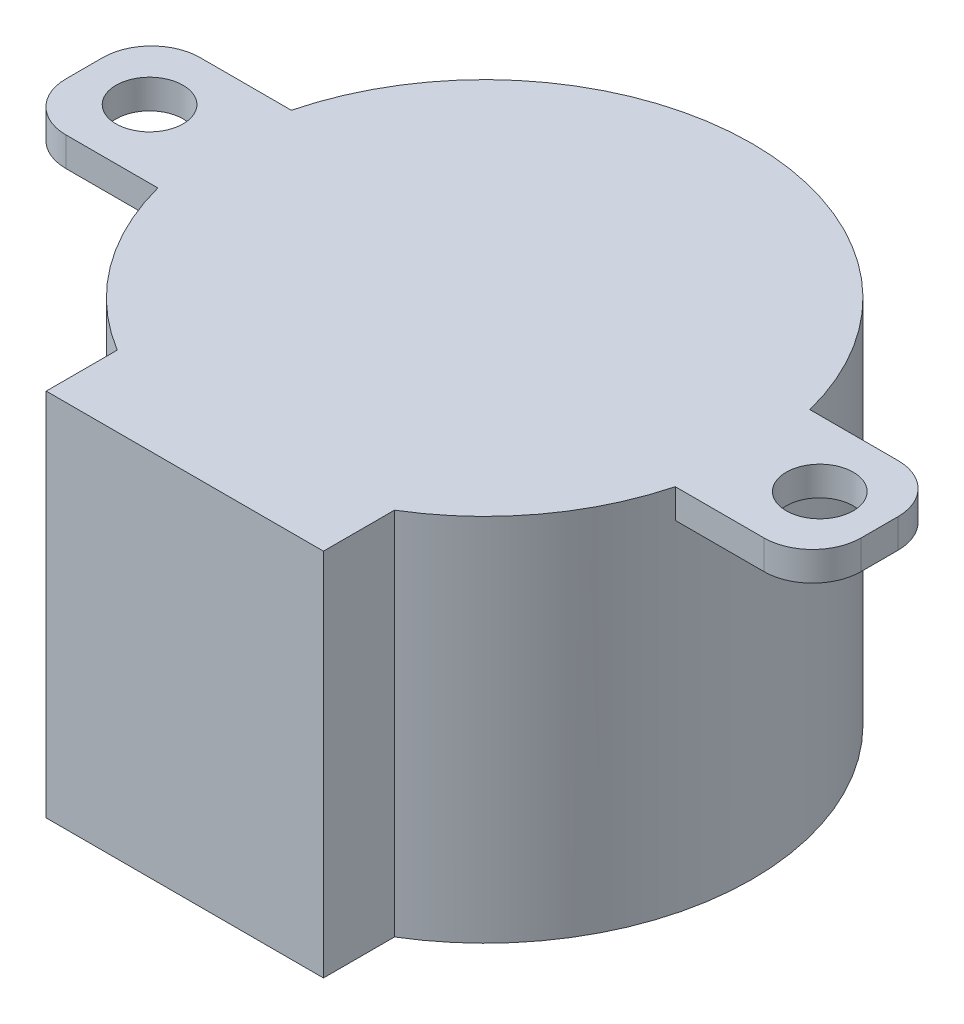
ISO-10303-21;
HEADER;
FILE_DESCRIPTION(('STEP AP214'),'2;1');
FILE_NAME('part.step','',(''),(''),'','','');
FILE_SCHEMA(('AUTOMOTIVE_DESIGN { 1 0 10303 214 1 1 1 1 }'));
ENDSEC;
DATA;
#1=APPLICATION_CONTEXT('core data for automotive mechanical design processes');
#2=APPLICATION_PROTOCOL_DEFINITION('international standard','automotive_design',2000,#1);
#3=PRODUCT_CONTEXT('',#1,'mechanical');
#4=PRODUCT('Part','Part','',(#3));
#5=PRODUCT_RELATED_PRODUCT_CATEGORY('part','',(#4));
#6=PRODUCT_DEFINITION_FORMATION('','',#4);
#7=PRODUCT_DEFINITION_CONTEXT('part definition',#1,'design');
#8=PRODUCT_DEFINITION('design','',#6,#7);
#9=PRODUCT_DEFINITION_SHAPE('','',#8);
#10=(LENGTH_UNIT() NAMED_UNIT(*) SI_UNIT(.MILLI.,.METRE.));
#11=(NAMED_UNIT(*) PLANE_ANGLE_UNIT() SI_UNIT($,.RADIAN.));
#12=(NAMED_UNIT(*) SI_UNIT($,.STERADIAN.) SOLID_ANGLE_UNIT());
#13=UNCERTAINTY_MEASURE_WITH_UNIT(LENGTH_MEASURE(1.E-05),#10,'distance_accuracy_value','');
#14=(GEOMETRIC_REPRESENTATION_CONTEXT(3) GLOBAL_UNCERTAINTY_ASSIGNED_CONTEXT((#13)) GLOBAL_UNIT_ASSIGNED_CONTEXT((#10,
#11,#12)) REPRESENTATION_CONTEXT('',''));
#15=CARTESIAN_POINT('',(0.,0.,0.));
#16=DIRECTION('',(0.,0.,1.));
#17=DIRECTION('',(1.,0.,0.));
#18=AXIS2_PLACEMENT_3D('',#15,#16,#17);
#19=CARTESIAN_POINT('',(0.,19.304,0.));
#20=DIRECTION('',(0.,1.,0.));
#21=DIRECTION('',(0.,0.,1.));
#22=AXIS2_PLACEMENT_3D('',#19,#20,#21);
#23=PLANE('',#22);
#24=CARTESIAN_POINT('',(17.499965,19.304,0.));
#25=DIRECTION('',(0.,1.,0.));
#26=DIRECTION('',(0.,0.,1.));
#27=AXIS2_PLACEMENT_3D('',#24,#25,#26);
#28=CIRCLE('',#27,1.75);
#29=CARTESIAN_POINT('',(17.499965,19.304,1.75));
#30=VERTEX_POINT('',#29);
#31=EDGE_CURVE('E160',#30,#30,#28,.T.);
#32=ORIENTED_EDGE('',*,*,#31,.F.);
#33=EDGE_LOOP('',(#32));
#34=FACE_BOUND('',#33,.T.);
#35=DIRECTION('',(0.,0.,-1.));
#36=VECTOR('',#35,1.);
#37=CARTESIAN_POINT('',(7.239,19.304,11.9481286819317));
#38=LINE('',#37,#36);
#39=CARTESIAN_POINT('',(7.239,19.304,15.658308150025));
#40=VERTEX_POINT('',#39);
#41=CARTESIAN_POINT('',(7.239,19.304,11.9481286819317));
#42=VERTEX_POINT('',#41);
#43=EDGE_CURVE('E167',#40,#42,#38,.T.);
#44=ORIENTED_EDGE('',*,*,#43,.T.);
#45=CARTESIAN_POINT('',(0.,19.304,0.));
#46=DIRECTION('',(0.,1.,0.));
#47=DIRECTION('',(0.,0.,1.));
#48=AXIS2_PLACEMENT_3D('',#45,#46,#47);
#49=CIRCLE('',#48,13.97);
#50=CARTESIAN_POINT('',(13.5098395253238,19.304,3.556));
#51=VERTEX_POINT('',#50);
#52=EDGE_CURVE('E91',#42,#51,#49,.T.);
#53=ORIENTED_EDGE('',*,*,#52,.T.);
#54=DIRECTION('',(1.,0.,0.));
#55=VECTOR('',#54,1.);
#56=CARTESIAN_POINT('',(13.5098395253238,19.304,3.556));
#57=LINE('',#56,#55);
#58=CARTESIAN_POINT('',(18.1390059016236,19.304,3.556));
#59=VERTEX_POINT('',#58);
#60=EDGE_CURVE('E284',#51,#59,#57,.T.);
#61=ORIENTED_EDGE('',*,*,#60,.T.);
#62=CARTESIAN_POINT('',(18.1390059016236,19.304,1.016));
#63=DIRECTION('',(0.,1.,0.));
#64=DIRECTION('',(0.,0.,1.));
#65=AXIS2_PLACEMENT_3D('',#62,#63,#64);
#66=CIRCLE('',#65,2.54);
#67=CARTESIAN_POINT('',(20.6790059016236,19.304,1.01599999999998));
#68=VERTEX_POINT('',#67);
#69=EDGE_CURVE('E287',#59,#68,#66,.T.);
#70=ORIENTED_EDGE('',*,*,#69,.T.);
#71=DIRECTION('',(0.,0.,-1.));
#72=VECTOR('',#71,1.);
#73=CARTESIAN_POINT('',(20.6790059016236,19.304,-0.903999999999982));
#74=LINE('',#73,#72);
#75=CARTESIAN_POINT('',(20.6790059016236,19.304,-0.903999999999982));
#76=VERTEX_POINT('',#75);
#77=EDGE_CURVE('E290',#68,#76,#74,.T.);
#78=ORIENTED_EDGE('',*,*,#77,.T.);
#79=CARTESIAN_POINT('',(18.1390059016236,19.304,-0.904));
#80=DIRECTION('',(0.,1.,0.));
#81=DIRECTION('',(0.,0.,-1.));
#82=AXIS2_PLACEMENT_3D('',#79,#80,#81);
#83=CIRCLE('',#82,2.54);
#84=CARTESIAN_POINT('',(18.1390059016236,19.304,-3.444));
#85=VERTEX_POINT('',#84);
#86=EDGE_CURVE('E293',#76,#85,#83,.T.);
#87=ORIENTED_EDGE('',*,*,#86,.T.);
#88=DIRECTION('',(-1.,0.,0.));
#89=VECTOR('',#88,1.);
#90=CARTESIAN_POINT('',(13.5388243211883,19.304,-3.444));
#91=LINE('',#90,#89);
#92=CARTESIAN_POINT('',(13.5388243211883,19.304,-3.444));
#93=VERTEX_POINT('',#92);
#94=EDGE_CURVE('E296',#85,#93,#91,.T.);
#95=ORIENTED_EDGE('',*,*,#94,.T.);
#96=CARTESIAN_POINT('',(0.,19.304,0.));
#97=DIRECTION('',(0.,1.,0.));
#98=DIRECTION('',(0.,0.,1.));
#99=AXIS2_PLACEMENT_3D('',#96,#97,#98);
#100=CIRCLE('',#99,13.97);
#101=CARTESIAN_POINT('',(-13.5388243211883,19.304,-3.444));
#102=VERTEX_POINT('',#101);
#103=EDGE_CURVE('E299',#93,#102,#100,.T.);
#104=ORIENTED_EDGE('',*,*,#103,.T.);
#105=DIRECTION('',(-1.,0.,0.));
#106=VECTOR('',#105,1.);
#107=CARTESIAN_POINT('',(-18.3054451484847,19.304,-3.444));
#108=LINE('',#107,#106);
#109=CARTESIAN_POINT('',(-18.3054451484847,19.304,-3.444));
#110=VERTEX_POINT('',#109);
#111=EDGE_CURVE('E302',#102,#110,#108,.T.);
#112=ORIENTED_EDGE('',*,*,#111,.T.);
#113=CARTESIAN_POINT('',(-18.3054451484847,19.304,-0.904));
#114=DIRECTION('',(0.,1.,0.));
#115=DIRECTION('',(0.,0.,1.));
#116=AXIS2_PLACEMENT_3D('',#113,#114,#115);
#117=CIRCLE('',#116,2.54);
#118=CARTESIAN_POINT('',(-20.8454451484847,19.304,-0.903999999999982));
#119=VERTEX_POINT('',#118);
#120=EDGE_CURVE('E305',#110,#119,#117,.T.);
#121=ORIENTED_EDGE('',*,*,#120,.T.);
#122=DIRECTION('',(0.,0.,1.));
#123=VECTOR('',#122,1.);
#124=CARTESIAN_POINT('',(-20.8454451484847,19.304,-0.903999999999982));
#125=LINE('',#124,#123);
#126=CARTESIAN_POINT('',(-20.8454451484847,19.304,1.01599999999998));
#127=VERTEX_POINT('',#126);
#128=EDGE_CURVE('E308',#119,#127,#125,.T.);
#129=ORIENTED_EDGE('',*,*,#128,.T.);
#130=CARTESIAN_POINT('',(-18.3054451484847,19.304,1.016));
#131=DIRECTION('',(0.,1.,0.));
#132=DIRECTION('',(0.,0.,1.));
#133=AXIS2_PLACEMENT_3D('',#130,#131,#132);
#134=CIRCLE('',#133,2.54);
#135=CARTESIAN_POINT('',(-18.3054451484847,19.304,3.556));
#136=VERTEX_POINT('',#135);
#137=EDGE_CURVE('E311',#127,#136,#134,.T.);
#138=ORIENTED_EDGE('',*,*,#137,.T.);
#139=DIRECTION('',(1.,0.,0.));
#140=VECTOR('',#139,1.);
#141=CARTESIAN_POINT('',(-18.3054451484847,19.304,3.556));
#142=LINE('',#141,#140);
#143=CARTESIAN_POINT('',(-13.5098395253238,19.304,3.55599999999999));
#144=VERTEX_POINT('',#143);
#145=EDGE_CURVE('E136',#136,#144,#142,.T.);
#146=ORIENTED_EDGE('',*,*,#145,.T.);
#147=CARTESIAN_POINT('',(0.,19.304,0.));
#148=DIRECTION('',(0.,1.,0.));
#149=DIRECTION('',(0.,0.,1.));
#150=AXIS2_PLACEMENT_3D('',#147,#148,#149);
#151=CIRCLE('',#150,13.97);
#152=CARTESIAN_POINT('',(-7.239,19.304,11.9481286819317));
#153=VERTEX_POINT('',#152);
#154=EDGE_CURVE('E130',#144,#153,#151,.T.);
#155=ORIENTED_EDGE('',*,*,#154,.T.);
#156=DIRECTION('',(0.,0.,1.));
#157=VECTOR('',#156,1.);
#158=CARTESIAN_POINT('',(-7.239,19.304,11.9481286819317));
#159=LINE('',#158,#157);
#160=CARTESIAN_POINT('',(-7.239,19.304,15.658308150025));
#161=VERTEX_POINT('',#160);
#162=EDGE_CURVE('E134',#153,#161,#159,.T.);
#163=ORIENTED_EDGE('',*,*,#162,.T.);
#164=DIRECTION('',(1.,0.,0.));
#165=VECTOR('',#164,1.);
#166=CARTESIAN_POINT('',(-7.239,19.304,15.658308150025));
#167=LINE('',#166,#165);
#168=EDGE_CURVE('E59',#161,#40,#167,.T.);
#169=ORIENTED_EDGE('',*,*,#168,.T.);
#170=EDGE_LOOP('',(#44,#53,#61,#70,#78,#87,#95,#104,#112,#121,#129,#138,#146,#155,#163,#169));
#171=FACE_BOUND('',#170,.T.);
#172=CARTESIAN_POINT('',(-17.499965,19.304,0.));
#173=DIRECTION('',(0.,1.,0.));
#174=DIRECTION('',(0.,0.,-1.));
#175=AXIS2_PLACEMENT_3D('',#172,#173,#174);
#176=CIRCLE('',#175,1.75);
#177=CARTESIAN_POINT('',(-17.499965,19.304,-1.75));
#178=VERTEX_POINT('',#177);
#179=EDGE_CURVE('E273',#178,#178,#176,.T.);
#180=ORIENTED_EDGE('',*,*,#179,.F.);
#181=EDGE_LOOP('',(#180));
#182=FACE_BOUND('',#181,.T.);
#183=ADVANCED_FACE('F39',(#34,#171,#182),#23,.T.);
#184=CARTESIAN_POINT('',(0.,0.,0.));
#185=DIRECTION('',(0.,1.,0.));
#186=DIRECTION('',(0.,0.,1.));
#187=AXIS2_PLACEMENT_3D('',#184,#185,#186);
#188=PLANE('',#187);
#189=CARTESIAN_POINT('',(0.,0.,0.));
#190=DIRECTION('',(0.,1.,0.));
#191=DIRECTION('',(0.,0.,1.));
#192=AXIS2_PLACEMENT_3D('',#189,#190,#191);
#193=CIRCLE('',#192,13.97);
#194=CARTESIAN_POINT('',(7.239,0.,11.9481286819317));
#195=VERTEX_POINT('',#194);
#196=CARTESIAN_POINT('',(-7.239,0.,11.9481286819317));
#197=VERTEX_POINT('',#196);
#198=EDGE_CURVE('E143',#195,#197,#193,.T.);
#199=ORIENTED_EDGE('',*,*,#198,.F.);
#200=DIRECTION('',(0.,0.,-1.));
#201=VECTOR('',#200,1.);
#202=CARTESIAN_POINT('',(7.239,0.,11.9481286819317));
#203=LINE('',#202,#201);
#204=CARTESIAN_POINT('',(7.239,0.,15.658308150025));
#205=VERTEX_POINT('',#204);
#206=EDGE_CURVE('E156',#205,#195,#203,.T.);
#207=ORIENTED_EDGE('',*,*,#206,.F.);
#208=DIRECTION('',(1.,0.,0.));
#209=VECTOR('',#208,1.);
#210=CARTESIAN_POINT('',(-7.239,0.,15.658308150025));
#211=LINE('',#210,#209);
#212=CARTESIAN_POINT('',(-7.239,0.,15.658308150025));
#213=VERTEX_POINT('',#212);
#214=EDGE_CURVE('E83',#213,#205,#211,.T.);
#215=ORIENTED_EDGE('',*,*,#214,.F.);
#216=DIRECTION('',(0.,0.,1.));
#217=VECTOR('',#216,1.);
#218=CARTESIAN_POINT('',(-7.239,0.,11.9481286819317));
#219=LINE('',#218,#217);
#220=EDGE_CURVE('E77',#197,#213,#219,.T.);
#221=ORIENTED_EDGE('',*,*,#220,.F.);
#222=EDGE_LOOP('',(#199,#207,#215,#221));
#223=FACE_BOUND('',#222,.T.);
#224=ADVANCED_FACE('F330',(#223),#188,.F.);
#225=CARTESIAN_POINT('',(7.239,19.304,11.9481286819317));
#226=DIRECTION('',(-1.,0.,0.));
#227=DIRECTION('',(0.,0.,1.));
#228=AXIS2_PLACEMENT_3D('',#225,#226,#227);
#229=PLANE('',#228);
#230=ORIENTED_EDGE('',*,*,#206,.T.);
#231=DIRECTION('',(0.,-1.,0.));
#232=VECTOR('',#231,1.);
#233=CARTESIAN_POINT('',(7.239,19.304,11.9481286819317));
#234=LINE('',#233,#232);
#235=EDGE_CURVE('E11',#42,#195,#234,.T.);
#236=ORIENTED_EDGE('',*,*,#235,.F.);
#237=ORIENTED_EDGE('',*,*,#43,.F.);
#238=DIRECTION('',(0.,-1.,0.));
#239=VECTOR('',#238,1.);
#240=CARTESIAN_POINT('',(7.239,19.304,15.658308150025));
#241=LINE('',#240,#239);
#242=EDGE_CURVE('E152',#40,#205,#241,.T.);
#243=ORIENTED_EDGE('',*,*,#242,.T.);
#244=EDGE_LOOP('',(#230,#236,#237,#243));
#245=FACE_BOUND('',#244,.T.);
#246=ADVANCED_FACE('F41',(#245),#229,.F.);
#247=CARTESIAN_POINT('',(13.5098395253238,19.304,3.556));
#248=DIRECTION('',(0.,0.,-1.));
#249=DIRECTION('',(-1.,0.,0.));
#250=AXIS2_PLACEMENT_3D('',#247,#248,#249);
#251=PLANE('',#250);
#252=DIRECTION('',(0.,-1.,0.));
#253=VECTOR('',#252,1.);
#254=CARTESIAN_POINT('',(13.5098395253238,19.304,3.556));
#255=LINE('',#254,#253);
#256=CARTESIAN_POINT('',(13.5098395253238,17.78,3.55599999999999));
#257=VERTEX_POINT('',#256);
#258=EDGE_CURVE('E50',#51,#257,#255,.T.);
#259=ORIENTED_EDGE('',*,*,#258,.T.);
#260=DIRECTION('',(1.,0.,0.));
#261=VECTOR('',#260,1.);
#262=CARTESIAN_POINT('',(0.,17.78,3.55599999999998));
#263=LINE('',#262,#261);
#264=CARTESIAN_POINT('',(18.1390059016236,17.78,3.556));
#265=VERTEX_POINT('',#264);
#266=EDGE_CURVE('E250',#257,#265,#263,.T.);
#267=ORIENTED_EDGE('',*,*,#266,.T.);
#268=DIRECTION('',(0.,-1.,0.));
#269=VECTOR('',#268,1.);
#270=CARTESIAN_POINT('',(18.1390059016236,19.304,3.556));
#271=LINE('',#270,#269);
#272=EDGE_CURVE('E210',#59,#265,#271,.T.);
#273=ORIENTED_EDGE('',*,*,#272,.F.);
#274=ORIENTED_EDGE('',*,*,#60,.F.);
#275=EDGE_LOOP('',(#259,#267,#273,#274));
#276=FACE_BOUND('',#275,.T.);
#277=ADVANCED_FACE('F379',(#276),#251,.F.);
#278=CARTESIAN_POINT('',(18.1390059016236,19.304,1.016));
#279=DIRECTION('',(0.,-1.,0.));
#280=DIRECTION('',(0.,0.,-1.));
#281=AXIS2_PLACEMENT_3D('',#278,#279,#280);
#282=CYLINDRICAL_SURFACE('',#281,2.54);
#283=ORIENTED_EDGE('',*,*,#272,.T.);
#284=CARTESIAN_POINT('',(18.1390059016236,17.78,1.016));
#285=DIRECTION('',(0.,1.,0.));
#286=DIRECTION('',(0.,0.,1.));
#287=AXIS2_PLACEMENT_3D('',#284,#285,#286);
#288=CIRCLE('',#287,2.54);
#289=CARTESIAN_POINT('',(20.6790059016236,17.78,1.01599999999998));
#290=VERTEX_POINT('',#289);
#291=EDGE_CURVE('E269',#265,#290,#288,.T.);
#292=ORIENTED_EDGE('',*,*,#291,.T.);
#293=DIRECTION('',(0.,-1.,0.));
#294=VECTOR('',#293,1.);
#295=CARTESIAN_POINT('',(20.6790059016236,19.304,1.01599999999998));
#296=LINE('',#295,#294);
#297=EDGE_CURVE('E206',#68,#290,#296,.T.);
#298=ORIENTED_EDGE('',*,*,#297,.F.);
#299=ORIENTED_EDGE('',*,*,#69,.F.);
#300=EDGE_LOOP('',(#283,#292,#298,#299));
#301=FACE_BOUND('',#300,.T.);
#302=ADVANCED_FACE('F376',(#301),#282,.T.);
#303=CARTESIAN_POINT('',(20.6790059016236,19.304,-0.903999999999982));
#304=DIRECTION('',(-1.,0.,0.));
#305=DIRECTION('',(0.,0.,1.));
#306=AXIS2_PLACEMENT_3D('',#303,#304,#305);
#307=PLANE('',#306);
#308=ORIENTED_EDGE('',*,*,#297,.T.);
#309=DIRECTION('',(0.,0.,-1.));
#310=VECTOR('',#309,1.);
#311=CARTESIAN_POINT('',(20.6790059016236,17.78,-0.903999999999982));
#312=LINE('',#311,#310);
#313=CARTESIAN_POINT('',(20.6790059016236,17.78,-0.903999999999982));
#314=VERTEX_POINT('',#313);
#315=EDGE_CURVE('E265',#290,#314,#312,.T.);
#316=ORIENTED_EDGE('',*,*,#315,.T.);
#317=DIRECTION('',(0.,-1.,0.));
#318=VECTOR('',#317,1.);
#319=CARTESIAN_POINT('',(20.6790059016236,19.304,-0.903999999999982));
#320=LINE('',#319,#318);
#321=EDGE_CURVE('E202',#76,#314,#320,.T.);
#322=ORIENTED_EDGE('',*,*,#321,.F.);
#323=ORIENTED_EDGE('',*,*,#77,.F.);
#324=EDGE_LOOP('',(#308,#316,#322,#323));
#325=FACE_BOUND('',#324,.T.);
#326=ADVANCED_FACE('F372',(#325),#307,.F.);
#327=CARTESIAN_POINT('',(18.1390059016236,19.304,-0.904));
#328=DIRECTION('',(0.,-1.,0.));
#329=DIRECTION('',(0.,0.,-1.));
#330=AXIS2_PLACEMENT_3D('',#327,#328,#329);
#331=CYLINDRICAL_SURFACE('',#330,2.54);
#332=ORIENTED_EDGE('',*,*,#321,.T.);
#333=CARTESIAN_POINT('',(18.1390059016236,17.78,-0.904));
#334=DIRECTION('',(0.,1.,0.));
#335=DIRECTION('',(0.,0.,1.));
#336=AXIS2_PLACEMENT_3D('',#333,#334,#335);
#337=CIRCLE('',#336,2.54);
#338=CARTESIAN_POINT('',(18.1390059016236,17.78,-3.444));
#339=VERTEX_POINT('',#338);
#340=EDGE_CURVE('E261',#314,#339,#337,.T.);
#341=ORIENTED_EDGE('',*,*,#340,.T.);
#342=DIRECTION('',(0.,-1.,0.));
#343=VECTOR('',#342,1.);
#344=CARTESIAN_POINT('',(18.1390059016236,19.304,-3.444));
#345=LINE('',#344,#343);
#346=EDGE_CURVE('E198',#85,#339,#345,.T.);
#347=ORIENTED_EDGE('',*,*,#346,.F.);
#348=ORIENTED_EDGE('',*,*,#86,.F.);
#349=EDGE_LOOP('',(#332,#341,#347,#348));
#350=FACE_BOUND('',#349,.T.);
#351=ADVANCED_FACE('F368',(#350),#331,.T.);
#352=CARTESIAN_POINT('',(13.5388243211883,19.304,-3.444));
#353=DIRECTION('',(0.,0.,1.));
#354=DIRECTION('',(1.,0.,0.));
#355=AXIS2_PLACEMENT_3D('',#352,#353,#354);
#356=PLANE('',#355);
#357=ORIENTED_EDGE('',*,*,#346,.T.);
#358=DIRECTION('',(-1.,0.,0.));
#359=VECTOR('',#358,1.);
#360=CARTESIAN_POINT('',(0.,17.78,-3.444));
#361=LINE('',#360,#359);
#362=CARTESIAN_POINT('',(13.5388243211883,17.78,-3.444));
#363=VERTEX_POINT('',#362);
#364=EDGE_CURVE('E242',#339,#363,#361,.T.);
#365=ORIENTED_EDGE('',*,*,#364,.T.);
#366=DIRECTION('',(0.,-1.,0.));
#367=VECTOR('',#366,1.);
#368=CARTESIAN_POINT('',(13.5388243211883,19.304,-3.444));
#369=LINE('',#368,#367);
#370=EDGE_CURVE('E194',#93,#363,#369,.T.);
#371=ORIENTED_EDGE('',*,*,#370,.F.);
#372=ORIENTED_EDGE('',*,*,#94,.F.);
#373=EDGE_LOOP('',(#357,#365,#371,#372));
#374=FACE_BOUND('',#373,.T.);
#375=ADVANCED_FACE('F364',(#374),#356,.F.);
#376=CARTESIAN_POINT('',(-18.3054451484847,19.304,-3.444));
#377=DIRECTION('',(0.,0.,1.));
#378=DIRECTION('',(1.,0.,0.));
#379=AXIS2_PLACEMENT_3D('',#376,#377,#378);
#380=PLANE('',#379);
#381=DIRECTION('',(0.,-1.,0.));
#382=VECTOR('',#381,1.);
#383=CARTESIAN_POINT('',(-13.5388243211883,19.304,-3.444));
#384=LINE('',#383,#382);
#385=CARTESIAN_POINT('',(-13.5388243211883,17.78,-3.444));
#386=VERTEX_POINT('',#385);
#387=EDGE_CURVE('E190',#102,#386,#384,.T.);
#388=ORIENTED_EDGE('',*,*,#387,.T.);
#389=DIRECTION('',(-1.,0.,0.));
#390=VECTOR('',#389,1.);
#391=CARTESIAN_POINT('',(0.,17.78,-3.444));
#392=LINE('',#391,#390);
#393=CARTESIAN_POINT('',(-18.3054451484847,17.78,-3.444));
#394=VERTEX_POINT('',#393);
#395=EDGE_CURVE('E238',#386,#394,#392,.T.);
#396=ORIENTED_EDGE('',*,*,#395,.T.);
#397=DIRECTION('',(0.,-1.,0.));
#398=VECTOR('',#397,1.);
#399=CARTESIAN_POINT('',(-18.3054451484847,19.304,-3.444));
#400=LINE('',#399,#398);
#401=EDGE_CURVE('E186',#110,#394,#400,.T.);
#402=ORIENTED_EDGE('',*,*,#401,.F.);
#403=ORIENTED_EDGE('',*,*,#111,.F.);
#404=EDGE_LOOP('',(#388,#396,#402,#403));
#405=FACE_BOUND('',#404,.T.);
#406=ADVANCED_FACE('F360',(#405),#380,.F.);
#407=CARTESIAN_POINT('',(-18.3054451484847,19.304,-0.904));
#408=DIRECTION('',(0.,-1.,0.));
#409=DIRECTION('',(0.,0.,-1.));
#410=AXIS2_PLACEMENT_3D('',#407,#408,#409);
#411=CYLINDRICAL_SURFACE('',#410,2.54);
#412=ORIENTED_EDGE('',*,*,#401,.T.);
#413=CARTESIAN_POINT('',(-18.3054451484847,17.78,-0.904));
#414=DIRECTION('',(0.,1.,0.));
#415=DIRECTION('',(0.,0.,1.));
#416=AXIS2_PLACEMENT_3D('',#413,#414,#415);
#417=CIRCLE('',#416,2.54);
#418=CARTESIAN_POINT('',(-20.8454451484847,17.78,-0.903999999999982));
#419=VERTEX_POINT('',#418);
#420=EDGE_CURVE('E257',#394,#419,#417,.T.);
#421=ORIENTED_EDGE('',*,*,#420,.T.);
#422=DIRECTION('',(0.,-1.,0.));
#423=VECTOR('',#422,1.);
#424=CARTESIAN_POINT('',(-20.8454451484847,19.304,-0.903999999999982));
#425=LINE('',#424,#423);
#426=EDGE_CURVE('E182',#119,#419,#425,.T.);
#427=ORIENTED_EDGE('',*,*,#426,.F.);
#428=ORIENTED_EDGE('',*,*,#120,.F.);
#429=EDGE_LOOP('',(#412,#421,#427,#428));
#430=FACE_BOUND('',#429,.T.);
#431=ADVANCED_FACE('F356',(#430),#411,.T.);
#432=CARTESIAN_POINT('',(-20.8454451484847,19.304,-0.903999999999982));
#433=DIRECTION('',(1.,0.,0.));
#434=DIRECTION('',(0.,0.,-1.));
#435=AXIS2_PLACEMENT_3D('',#432,#433,#434);
#436=PLANE('',#435);
#437=ORIENTED_EDGE('',*,*,#426,.T.);
#438=DIRECTION('',(0.,0.,1.));
#439=VECTOR('',#438,1.);
#440=CARTESIAN_POINT('',(-20.8454451484847,17.78,-0.903999999999982));
#441=LINE('',#440,#439);
#442=CARTESIAN_POINT('',(-20.8454451484847,17.78,1.01599999999998));
#443=VERTEX_POINT('',#442);
#444=EDGE_CURVE('E226',#419,#443,#441,.T.);
#445=ORIENTED_EDGE('',*,*,#444,.T.);
#446=DIRECTION('',(0.,-1.,0.));
#447=VECTOR('',#446,1.);
#448=CARTESIAN_POINT('',(-20.8454451484847,19.304,1.01599999999998));
#449=LINE('',#448,#447);
#450=EDGE_CURVE('E178',#127,#443,#449,.T.);
#451=ORIENTED_EDGE('',*,*,#450,.F.);
#452=ORIENTED_EDGE('',*,*,#128,.F.);
#453=EDGE_LOOP('',(#437,#445,#451,#452));
#454=FACE_BOUND('',#453,.T.);
#455=ADVANCED_FACE('F352',(#454),#436,.F.);
#456=CARTESIAN_POINT('',(-18.3054451484847,19.304,1.016));
#457=DIRECTION('',(0.,-1.,0.));
#458=DIRECTION('',(0.,0.,-1.));
#459=AXIS2_PLACEMENT_3D('',#456,#457,#458);
#460=CYLINDRICAL_SURFACE('',#459,2.54);
#461=ORIENTED_EDGE('',*,*,#450,.T.);
#462=CARTESIAN_POINT('',(-18.3054451484847,17.78,1.016));
#463=DIRECTION('',(0.,1.,0.));
#464=DIRECTION('',(0.,0.,1.));
#465=AXIS2_PLACEMENT_3D('',#462,#463,#464);
#466=CIRCLE('',#465,2.54);
#467=CARTESIAN_POINT('',(-18.3054451484847,17.78,3.556));
#468=VERTEX_POINT('',#467);
#469=EDGE_CURVE('E219',#443,#468,#466,.T.);
#470=ORIENTED_EDGE('',*,*,#469,.T.);
#471=DIRECTION('',(0.,-1.,0.));
#472=VECTOR('',#471,1.);
#473=CARTESIAN_POINT('',(-18.3054451484847,19.304,3.556));
#474=LINE('',#473,#472);
#475=EDGE_CURVE('E174',#136,#468,#474,.T.);
#476=ORIENTED_EDGE('',*,*,#475,.F.);
#477=ORIENTED_EDGE('',*,*,#137,.F.);
#478=EDGE_LOOP('',(#461,#470,#476,#477));
#479=FACE_BOUND('',#478,.T.);
#480=ADVANCED_FACE('F348',(#479),#460,.T.);
#481=CARTESIAN_POINT('',(-18.3054451484847,19.304,3.556));
#482=DIRECTION('',(0.,0.,-1.));
#483=DIRECTION('',(-1.,0.,0.));
#484=AXIS2_PLACEMENT_3D('',#481,#482,#483);
#485=PLANE('',#484);
#486=ORIENTED_EDGE('',*,*,#475,.T.);
#487=DIRECTION('',(1.,0.,0.));
#488=VECTOR('',#487,1.);
#489=CARTESIAN_POINT('',(0.,17.78,3.55599999999998));
#490=LINE('',#489,#488);
#491=CARTESIAN_POINT('',(-13.5098395253238,17.78,3.55599999999999));
#492=VERTEX_POINT('',#491);
#493=EDGE_CURVE('E229',#468,#492,#490,.T.);
#494=ORIENTED_EDGE('',*,*,#493,.T.);
#495=DIRECTION('',(0.,-1.,0.));
#496=VECTOR('',#495,1.);
#497=CARTESIAN_POINT('',(-13.5098395253238,19.304,3.55599999999999));
#498=LINE('',#497,#496);
#499=EDGE_CURVE('E145',#144,#492,#498,.T.);
#500=ORIENTED_EDGE('',*,*,#499,.F.);
#501=ORIENTED_EDGE('',*,*,#145,.F.);
#502=EDGE_LOOP('',(#486,#494,#500,#501));
#503=FACE_BOUND('',#502,.T.);
#504=ADVANCED_FACE('F345',(#503),#485,.F.);
#505=CARTESIAN_POINT('',(0.,19.304,0.));
#506=DIRECTION('',(0.,-1.,0.));
#507=DIRECTION('',(0.,0.,-1.));
#508=AXIS2_PLACEMENT_3D('',#505,#506,#507);
#509=CYLINDRICAL_SURFACE('',#508,13.97);
#510=ORIENTED_EDGE('',*,*,#198,.T.);
#511=DIRECTION('',(0.,-1.,0.));
#512=VECTOR('',#511,1.);
#513=CARTESIAN_POINT('',(-7.239,19.304,11.9481286819317));
#514=LINE('',#513,#512);
#515=EDGE_CURVE('E141',#153,#197,#514,.T.);
#516=ORIENTED_EDGE('',*,*,#515,.F.);
#517=ORIENTED_EDGE('',*,*,#154,.F.);
#518=ORIENTED_EDGE('',*,*,#499,.T.);
#519=CARTESIAN_POINT('',(0.,17.78,0.));
#520=DIRECTION('',(0.,1.,0.));
#521=DIRECTION('',(0.,0.,1.));
#522=AXIS2_PLACEMENT_3D('',#519,#520,#521);
#523=CIRCLE('',#522,13.97);
#524=EDGE_CURVE('E220',#386,#492,#523,.T.);
#525=ORIENTED_EDGE('',*,*,#524,.F.);
#526=ORIENTED_EDGE('',*,*,#387,.F.);
#527=ORIENTED_EDGE('',*,*,#103,.F.);
#528=ORIENTED_EDGE('',*,*,#370,.T.);
#529=CARTESIAN_POINT('',(0.,17.78,0.));
#530=DIRECTION('',(0.,1.,0.));
#531=DIRECTION('',(0.,0.,1.));
#532=AXIS2_PLACEMENT_3D('',#529,#530,#531);
#533=CIRCLE('',#532,13.97);
#534=EDGE_CURVE('E246',#257,#363,#533,.T.);
#535=ORIENTED_EDGE('',*,*,#534,.F.);
#536=ORIENTED_EDGE('',*,*,#258,.F.);
#537=ORIENTED_EDGE('',*,*,#52,.F.);
#538=ORIENTED_EDGE('',*,*,#235,.T.);
#539=EDGE_LOOP('',(#510,#516,#517,#518,#525,#526,#527,#528,#535,#536,#537,#538));
#540=FACE_BOUND('',#539,.T.);
#541=ADVANCED_FACE('F142',(#540),#509,.T.);
#542=CARTESIAN_POINT('',(-7.239,19.304,11.9481286819317));
#543=DIRECTION('',(1.,0.,0.));
#544=DIRECTION('',(0.,0.,-1.));
#545=AXIS2_PLACEMENT_3D('',#542,#543,#544);
#546=PLANE('',#545);
#547=ORIENTED_EDGE('',*,*,#220,.T.);
#548=DIRECTION('',(0.,-1.,0.));
#549=VECTOR('',#548,1.);
#550=CARTESIAN_POINT('',(-7.239,19.304,15.658308150025));
#551=LINE('',#550,#549);
#552=EDGE_CURVE('E146',#161,#213,#551,.T.);
#553=ORIENTED_EDGE('',*,*,#552,.F.);
#554=ORIENTED_EDGE('',*,*,#162,.F.);
#555=ORIENTED_EDGE('',*,*,#515,.T.);
#556=EDGE_LOOP('',(#547,#553,#554,#555));
#557=FACE_BOUND('',#556,.T.);
#558=ADVANCED_FACE('F148',(#557),#546,.F.);
#559=CARTESIAN_POINT('',(-7.239,19.304,15.658308150025));
#560=DIRECTION('',(0.,0.,-1.));
#561=DIRECTION('',(-1.,0.,0.));
#562=AXIS2_PLACEMENT_3D('',#559,#560,#561);
#563=PLANE('',#562);
#564=ORIENTED_EDGE('',*,*,#214,.T.);
#565=ORIENTED_EDGE('',*,*,#242,.F.);
#566=ORIENTED_EDGE('',*,*,#168,.F.);
#567=ORIENTED_EDGE('',*,*,#552,.T.);
#568=EDGE_LOOP('',(#564,#565,#566,#567));
#569=FACE_BOUND('',#568,.T.);
#570=ADVANCED_FACE('F325',(#569),#563,.F.);
#571=CARTESIAN_POINT('',(17.499965,19.304,0.));
#572=DIRECTION('',(0.,-1.,0.));
#573=DIRECTION('',(0.,0.,-1.));
#574=AXIS2_PLACEMENT_3D('',#571,#572,#573);
#575=CYLINDRICAL_SURFACE('',#574,1.75);
#576=CARTESIAN_POINT('',(17.499965,17.78,0.));
#577=DIRECTION('',(0.,1.,0.));
#578=DIRECTION('',(0.,0.,1.));
#579=AXIS2_PLACEMENT_3D('',#576,#577,#578);
#580=CIRCLE('',#579,1.75);
#581=CARTESIAN_POINT('',(17.499965,17.78,1.75));
#582=VERTEX_POINT('',#581);
#583=EDGE_CURVE('E43',#582,#582,#580,.T.);
#584=ORIENTED_EDGE('',*,*,#583,.F.);
#585=EDGE_LOOP('',(#584));
#586=FACE_BOUND('',#585,.T.);
#587=ORIENTED_EDGE('',*,*,#31,.T.);
#588=EDGE_LOOP('',(#587));
#589=FACE_BOUND('',#588,.T.);
#590=ADVANCED_FACE('F321',(#586,#589),#575,.F.);
#591=CARTESIAN_POINT('',(-17.499965,19.304,0.));
#592=DIRECTION('',(0.,-1.,0.));
#593=DIRECTION('',(0.,0.,-1.));
#594=AXIS2_PLACEMENT_3D('',#591,#592,#593);
#595=CYLINDRICAL_SURFACE('',#594,1.75);
#596=CARTESIAN_POINT('',(-17.499965,17.78,0.));
#597=DIRECTION('',(0.,1.,0.));
#598=DIRECTION('',(0.,0.,1.));
#599=AXIS2_PLACEMENT_3D('',#596,#597,#598);
#600=CIRCLE('',#599,1.75);
#601=CARTESIAN_POINT('',(-17.499965,17.78,1.75));
#602=VERTEX_POINT('',#601);
#603=EDGE_CURVE('E216',#602,#602,#600,.T.);
#604=ORIENTED_EDGE('',*,*,#603,.F.);
#605=EDGE_LOOP('',(#604));
#606=FACE_BOUND('',#605,.T.);
#607=ORIENTED_EDGE('',*,*,#179,.T.);
#608=EDGE_LOOP('',(#607));
#609=FACE_BOUND('',#608,.T.);
#610=ADVANCED_FACE('F324',(#606,#609),#595,.F.);
#611=CARTESIAN_POINT('',(0.,17.78,0.));
#612=DIRECTION('',(0.,1.,0.));
#613=DIRECTION('',(0.,0.,1.));
#614=AXIS2_PLACEMENT_3D('',#611,#612,#613);
#615=PLANE('',#614);
#616=ORIENTED_EDGE('',*,*,#603,.T.);
#617=EDGE_LOOP('',(#616));
#618=FACE_BOUND('',#617,.T.);
#619=ORIENTED_EDGE('',*,*,#395,.F.);
#620=ORIENTED_EDGE('',*,*,#524,.T.);
#621=ORIENTED_EDGE('',*,*,#493,.F.);
#622=ORIENTED_EDGE('',*,*,#469,.F.);
#623=ORIENTED_EDGE('',*,*,#444,.F.);
#624=ORIENTED_EDGE('',*,*,#420,.F.);
#625=EDGE_LOOP('',(#619,#620,#621,#622,#623,#624));
#626=FACE_BOUND('',#625,.T.);
#627=ADVANCED_FACE('F427',(#618,#626),#615,.F.);
#628=CARTESIAN_POINT('',(18.3054451484847,17.78,-0.903999999999981));
#629=DIRECTION('',(0.,1.,0.));
#630=DIRECTION('',(0.,0.,1.));
#631=AXIS2_PLACEMENT_3D('',#628,#629,#630);
#632=PLANE('',#631);
#633=ORIENTED_EDGE('',*,*,#583,.T.);
#634=EDGE_LOOP('',(#633));
#635=FACE_BOUND('',#634,.T.);
#636=ORIENTED_EDGE('',*,*,#266,.F.);
#637=ORIENTED_EDGE('',*,*,#534,.T.);
#638=ORIENTED_EDGE('',*,*,#364,.F.);
#639=ORIENTED_EDGE('',*,*,#340,.F.);
#640=ORIENTED_EDGE('',*,*,#315,.F.);
#641=ORIENTED_EDGE('',*,*,#291,.F.);
#642=EDGE_LOOP('',(#636,#637,#638,#639,#640,#641));
#643=FACE_BOUND('',#642,.T.);
#644=ADVANCED_FACE('F318',(#635,#643),#632,.F.);
#645=CLOSED_SHELL('',(#183,#224,#246,#277,#302,#326,#351,#375,#406,#431,#455,#480,#504,#541,
#558,#570,#590,#610,#627,#644));
#646=MANIFOLD_SOLID_BREP('B2',#645);
#647=ADVANCED_BREP_SHAPE_REPRESENTATION('',(#18,#646),#14);
#648=SHAPE_DEFINITION_REPRESENTATION(#9,#647);
ENDSEC;
END-ISO-10303-21;
